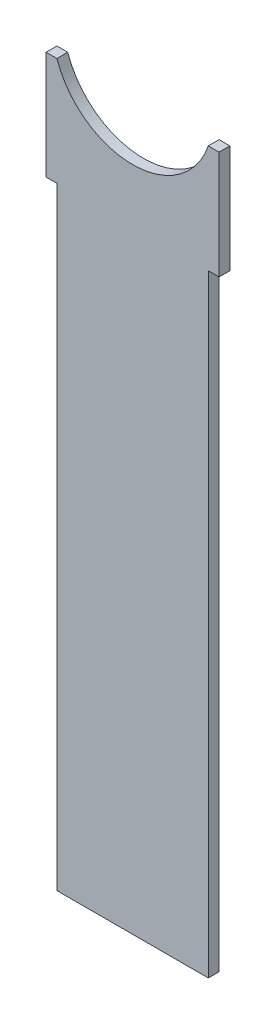
ISO-10303-21;
HEADER;
FILE_DESCRIPTION(('STEP AP214'),'2;1');
FILE_NAME('part.step','',(''),(''),'','','');
FILE_SCHEMA(('AUTOMOTIVE_DESIGN { 1 0 10303 214 1 1 1 1 }'));
ENDSEC;
DATA;
#1=APPLICATION_CONTEXT('core data for automotive mechanical design processes');
#2=APPLICATION_PROTOCOL_DEFINITION('international standard','automotive_design',2000,#1);
#3=PRODUCT_CONTEXT('',#1,'mechanical');
#4=PRODUCT('Part','Part','',(#3));
#5=PRODUCT_RELATED_PRODUCT_CATEGORY('part','',(#4));
#6=PRODUCT_DEFINITION_FORMATION('','',#4);
#7=PRODUCT_DEFINITION_CONTEXT('part definition',#1,'design');
#8=PRODUCT_DEFINITION('design','',#6,#7);
#9=PRODUCT_DEFINITION_SHAPE('','',#8);
#10=(LENGTH_UNIT() NAMED_UNIT(*) SI_UNIT(.MILLI.,.METRE.));
#11=(NAMED_UNIT(*) PLANE_ANGLE_UNIT() SI_UNIT($,.RADIAN.));
#12=(NAMED_UNIT(*) SI_UNIT($,.STERADIAN.) SOLID_ANGLE_UNIT());
#13=UNCERTAINTY_MEASURE_WITH_UNIT(LENGTH_MEASURE(1.E-05),#10,'distance_accuracy_value','');
#14=(GEOMETRIC_REPRESENTATION_CONTEXT(3) GLOBAL_UNCERTAINTY_ASSIGNED_CONTEXT((#13)) GLOBAL_UNIT_ASSIGNED_CONTEXT((#10,
#11,#12)) REPRESENTATION_CONTEXT('',''));
#15=CARTESIAN_POINT('',(0.,0.,0.));
#16=DIRECTION('',(0.,0.,1.));
#17=DIRECTION('',(1.,0.,0.));
#18=AXIS2_PLACEMENT_3D('',#15,#16,#17);
#19=CARTESIAN_POINT('',(12.7,0.,1.5875));
#20=DIRECTION('',(-1.,0.,0.));
#21=DIRECTION('',(0.,-1.,0.));
#22=AXIS2_PLACEMENT_3D('',#19,#20,#21);
#23=PLANE('',#22);
#24=DIRECTION('',(0.,1.,0.));
#25=VECTOR('',#24,1.);
#26=CARTESIAN_POINT('',(12.7,0.,0.));
#27=LINE('',#26,#25);
#28=CARTESIAN_POINT('',(12.7,-15.875,0.));
#29=VERTEX_POINT('',#28);
#30=CARTESIAN_POINT('',(12.7,0.,0.));
#31=VERTEX_POINT('',#30);
#32=EDGE_CURVE('E141',#29,#31,#27,.T.);
#33=ORIENTED_EDGE('',*,*,#32,.T.);
#34=DIRECTION('',(0.,0.,-1.));
#35=VECTOR('',#34,1.);
#36=CARTESIAN_POINT('',(12.7,0.,1.5875));
#37=LINE('',#36,#35);
#38=CARTESIAN_POINT('',(12.7,0.,1.5875));
#39=VERTEX_POINT('',#38);
#40=EDGE_CURVE('E11',#39,#31,#37,.T.);
#41=ORIENTED_EDGE('',*,*,#40,.F.);
#42=DIRECTION('',(0.,1.,0.));
#43=VECTOR('',#42,1.);
#44=CARTESIAN_POINT('',(12.7,0.,1.5875));
#45=LINE('',#44,#43);
#46=CARTESIAN_POINT('',(12.7,-15.875,1.5875));
#47=VERTEX_POINT('',#46);
#48=EDGE_CURVE('E92',#47,#39,#45,.T.);
#49=ORIENTED_EDGE('',*,*,#48,.F.);
#50=DIRECTION('',(0.,0.,-1.));
#51=VECTOR('',#50,1.);
#52=CARTESIAN_POINT('',(12.7,-15.875,1.5875));
#53=LINE('',#52,#51);
#54=EDGE_CURVE('E137',#47,#29,#53,.T.);
#55=ORIENTED_EDGE('',*,*,#54,.T.);
#56=EDGE_LOOP('',(#33,#41,#49,#55));
#57=FACE_BOUND('',#56,.T.);
#58=ADVANCED_FACE('F34',(#57),#23,.F.);
#59=CARTESIAN_POINT('',(0.,0.,1.5875));
#60=DIRECTION('',(0.,1.,0.));
#61=DIRECTION('',(-1.,0.,0.));
#62=AXIS2_PLACEMENT_3D('',#59,#60,#61);
#63=PLANE('',#62);
#64=DIRECTION('',(1.,0.,0.));
#65=VECTOR('',#64,1.);
#66=CARTESIAN_POINT('',(0.,0.,0.));
#67=LINE('',#66,#65);
#68=CARTESIAN_POINT('',(11.1125,0.,0.));
#69=VERTEX_POINT('',#68);
#70=EDGE_CURVE('E144',#69,#31,#67,.T.);
#71=ORIENTED_EDGE('',*,*,#70,.F.);
#72=DIRECTION('',(0.,0.,-1.));
#73=VECTOR('',#72,1.);
#74=CARTESIAN_POINT('',(11.1125,0.,1.5875));
#75=LINE('',#74,#73);
#76=CARTESIAN_POINT('',(11.1125,0.,1.5875));
#77=VERTEX_POINT('',#76);
#78=EDGE_CURVE('E42',#77,#69,#75,.T.);
#79=ORIENTED_EDGE('',*,*,#78,.F.);
#80=DIRECTION('',(1.,0.,0.));
#81=VECTOR('',#80,1.);
#82=CARTESIAN_POINT('',(0.,0.,1.5875));
#83=LINE('',#82,#81);
#84=EDGE_CURVE('E199',#77,#39,#83,.T.);
#85=ORIENTED_EDGE('',*,*,#84,.T.);
#86=ORIENTED_EDGE('',*,*,#40,.T.);
#87=EDGE_LOOP('',(#71,#79,#85,#86));
#88=FACE_BOUND('',#87,.T.);
#89=ADVANCED_FACE('F184',(#88),#63,.T.);
#90=CARTESIAN_POINT('',(0.,3.80999999999999,1.5875));
#91=DIRECTION('',(0.,0.,-1.));
#92=DIRECTION('',(-1.,0.,0.));
#93=AXIS2_PLACEMENT_3D('',#90,#91,#92);
#94=CYLINDRICAL_SURFACE('',#93,11.7475);
#95=CARTESIAN_POINT('',(0.,3.80999999999999,0.));
#96=DIRECTION('',(0.,0.,1.));
#97=DIRECTION('',(1.,0.,0.));
#98=AXIS2_PLACEMENT_3D('',#95,#96,#97);
#99=CIRCLE('',#98,11.7475);
#100=CARTESIAN_POINT('',(-11.1125,0.,0.));
#101=VERTEX_POINT('',#100);
#102=EDGE_CURVE('E147',#101,#69,#99,.T.);
#103=ORIENTED_EDGE('',*,*,#102,.F.);
#104=DIRECTION('',(0.,0.,-1.));
#105=VECTOR('',#104,1.);
#106=CARTESIAN_POINT('',(-11.1125,0.,1.5875));
#107=LINE('',#106,#105);
#108=CARTESIAN_POINT('',(-11.1125,0.,1.5875));
#109=VERTEX_POINT('',#108);
#110=EDGE_CURVE('E174',#109,#101,#107,.T.);
#111=ORIENTED_EDGE('',*,*,#110,.F.);
#112=CARTESIAN_POINT('',(0.,3.80999999999999,1.5875));
#113=DIRECTION('',(0.,0.,1.));
#114=DIRECTION('',(1.,0.,0.));
#115=AXIS2_PLACEMENT_3D('',#112,#113,#114);
#116=CIRCLE('',#115,11.7475);
#117=EDGE_CURVE('E181',#109,#77,#116,.T.);
#118=ORIENTED_EDGE('',*,*,#117,.T.);
#119=ORIENTED_EDGE('',*,*,#78,.T.);
#120=EDGE_LOOP('',(#103,#111,#118,#119));
#121=FACE_BOUND('',#120,.T.);
#122=ADVANCED_FACE('F179',(#121),#94,.F.);
#123=CARTESIAN_POINT('',(0.,0.,1.5875));
#124=DIRECTION('',(0.,-1.,0.));
#125=DIRECTION('',(1.,0.,0.));
#126=AXIS2_PLACEMENT_3D('',#123,#124,#125);
#127=PLANE('',#126);
#128=DIRECTION('',(-1.,0.,0.));
#129=VECTOR('',#128,1.);
#130=CARTESIAN_POINT('',(0.,0.,0.));
#131=LINE('',#130,#129);
#132=CARTESIAN_POINT('',(-12.7,0.,0.));
#133=VERTEX_POINT('',#132);
#134=EDGE_CURVE('E150',#101,#133,#131,.T.);
#135=ORIENTED_EDGE('',*,*,#134,.T.);
#136=DIRECTION('',(0.,0.,-1.));
#137=VECTOR('',#136,1.);
#138=CARTESIAN_POINT('',(-12.7,0.,1.5875));
#139=LINE('',#138,#137);
#140=CARTESIAN_POINT('',(-12.7,0.,1.5875));
#141=VERTEX_POINT('',#140);
#142=EDGE_CURVE('E172',#141,#133,#139,.T.);
#143=ORIENTED_EDGE('',*,*,#142,.F.);
#144=DIRECTION('',(-1.,0.,0.));
#145=VECTOR('',#144,1.);
#146=CARTESIAN_POINT('',(0.,0.,1.5875));
#147=LINE('',#146,#145);
#148=EDGE_CURVE('E195',#109,#141,#147,.T.);
#149=ORIENTED_EDGE('',*,*,#148,.F.);
#150=ORIENTED_EDGE('',*,*,#110,.T.);
#151=EDGE_LOOP('',(#135,#143,#149,#150));
#152=FACE_BOUND('',#151,.T.);
#153=ADVANCED_FACE('F192',(#152),#127,.F.);
#154=CARTESIAN_POINT('',(-12.7,0.,1.5875));
#155=DIRECTION('',(-1.,0.,0.));
#156=DIRECTION('',(0.,-1.,0.));
#157=AXIS2_PLACEMENT_3D('',#154,#155,#156);
#158=PLANE('',#157);
#159=DIRECTION('',(0.,1.,0.));
#160=VECTOR('',#159,1.);
#161=CARTESIAN_POINT('',(-12.7,0.,0.));
#162=LINE('',#161,#160);
#163=CARTESIAN_POINT('',(-12.7,-15.875,0.));
#164=VERTEX_POINT('',#163);
#165=EDGE_CURVE('E153',#164,#133,#162,.T.);
#166=ORIENTED_EDGE('',*,*,#165,.F.);
#167=DIRECTION('',(0.,0.,-1.));
#168=VECTOR('',#167,1.);
#169=CARTESIAN_POINT('',(-12.7,-15.875,1.5875));
#170=LINE('',#169,#168);
#171=CARTESIAN_POINT('',(-12.7,-15.875,1.5875));
#172=VERTEX_POINT('',#171);
#173=EDGE_CURVE('E170',#172,#164,#170,.T.);
#174=ORIENTED_EDGE('',*,*,#173,.F.);
#175=DIRECTION('',(0.,1.,0.));
#176=VECTOR('',#175,1.);
#177=CARTESIAN_POINT('',(-12.7,0.,1.5875));
#178=LINE('',#177,#176);
#179=EDGE_CURVE('E197',#172,#141,#178,.T.);
#180=ORIENTED_EDGE('',*,*,#179,.T.);
#181=ORIENTED_EDGE('',*,*,#142,.T.);
#182=EDGE_LOOP('',(#166,#174,#180,#181));
#183=FACE_BOUND('',#182,.T.);
#184=ADVANCED_FACE('F211',(#183),#158,.T.);
#185=CARTESIAN_POINT('',(0.,-15.875,1.5875));
#186=DIRECTION('',(0.,-1.,0.));
#187=DIRECTION('',(1.,0.,0.));
#188=AXIS2_PLACEMENT_3D('',#185,#186,#187);
#189=PLANE('',#188);
#190=DIRECTION('',(-1.,0.,0.));
#191=VECTOR('',#190,1.);
#192=CARTESIAN_POINT('',(0.,-15.875,0.));
#193=LINE('',#192,#191);
#194=CARTESIAN_POINT('',(-11.1125,-15.875,0.));
#195=VERTEX_POINT('',#194);
#196=EDGE_CURVE('E156',#195,#164,#193,.T.);
#197=ORIENTED_EDGE('',*,*,#196,.F.);
#198=DIRECTION('',(0.,0.,-1.));
#199=VECTOR('',#198,1.);
#200=CARTESIAN_POINT('',(-11.1125,-15.875,1.5875));
#201=LINE('',#200,#199);
#202=CARTESIAN_POINT('',(-11.1125,-15.875,1.5875));
#203=VERTEX_POINT('',#202);
#204=EDGE_CURVE('E168',#203,#195,#201,.T.);
#205=ORIENTED_EDGE('',*,*,#204,.F.);
#206=DIRECTION('',(-1.,0.,0.));
#207=VECTOR('',#206,1.);
#208=CARTESIAN_POINT('',(0.,-15.875,1.5875));
#209=LINE('',#208,#207);
#210=EDGE_CURVE('E205',#203,#172,#209,.T.);
#211=ORIENTED_EDGE('',*,*,#210,.T.);
#212=ORIENTED_EDGE('',*,*,#173,.T.);
#213=EDGE_LOOP('',(#197,#205,#211,#212));
#214=FACE_BOUND('',#213,.T.);
#215=ADVANCED_FACE('F209',(#214),#189,.T.);
#216=CARTESIAN_POINT('',(-11.1125,0.,1.5875));
#217=DIRECTION('',(1.,0.,0.));
#218=DIRECTION('',(0.,1.,0.));
#219=AXIS2_PLACEMENT_3D('',#216,#217,#218);
#220=PLANE('',#219);
#221=DIRECTION('',(0.,-1.,0.));
#222=VECTOR('',#221,1.);
#223=CARTESIAN_POINT('',(-11.1125,0.,0.));
#224=LINE('',#223,#222);
#225=CARTESIAN_POINT('',(-11.1125,-105.804584262909,0.));
#226=VERTEX_POINT('',#225);
#227=EDGE_CURVE('E159',#195,#226,#224,.T.);
#228=ORIENTED_EDGE('',*,*,#227,.T.);
#229=DIRECTION('',(0.,0.,-1.));
#230=VECTOR('',#229,1.);
#231=CARTESIAN_POINT('',(-11.1125,-105.804584262909,1.5875));
#232=LINE('',#231,#230);
#233=CARTESIAN_POINT('',(-11.1125,-105.804584262909,1.5875));
#234=VERTEX_POINT('',#233);
#235=EDGE_CURVE('E133',#234,#226,#232,.T.);
#236=ORIENTED_EDGE('',*,*,#235,.F.);
#237=DIRECTION('',(0.,-1.,0.));
#238=VECTOR('',#237,1.);
#239=CARTESIAN_POINT('',(-11.1125,0.,1.5875));
#240=LINE('',#239,#238);
#241=EDGE_CURVE('E120',#203,#234,#240,.T.);
#242=ORIENTED_EDGE('',*,*,#241,.F.);
#243=ORIENTED_EDGE('',*,*,#204,.T.);
#244=EDGE_LOOP('',(#228,#236,#242,#243));
#245=FACE_BOUND('',#244,.T.);
#246=ADVANCED_FACE('F214',(#245),#220,.F.);
#247=CARTESIAN_POINT('',(0.,-105.804584262909,1.5875));
#248=DIRECTION('',(0.,1.,0.));
#249=DIRECTION('',(0.,0.,1.));
#250=AXIS2_PLACEMENT_3D('',#247,#248,#249);
#251=PLANE('',#250);
#252=DIRECTION('',(1.,0.,0.));
#253=VECTOR('',#252,1.);
#254=CARTESIAN_POINT('',(0.,-105.804584262909,0.));
#255=LINE('',#254,#253);
#256=CARTESIAN_POINT('',(11.1125,-105.804584262909,0.));
#257=VERTEX_POINT('',#256);
#258=EDGE_CURVE('E129',#226,#257,#255,.T.);
#259=ORIENTED_EDGE('',*,*,#258,.T.);
#260=DIRECTION('',(0.,0.,-1.));
#261=VECTOR('',#260,1.);
#262=CARTESIAN_POINT('',(11.1125,-105.804584262909,1.5875));
#263=LINE('',#262,#261);
#264=CARTESIAN_POINT('',(11.1125,-105.804584262909,1.5875));
#265=VERTEX_POINT('',#264);
#266=EDGE_CURVE('E126',#265,#257,#263,.T.);
#267=ORIENTED_EDGE('',*,*,#266,.F.);
#268=DIRECTION('',(1.,0.,0.));
#269=VECTOR('',#268,1.);
#270=CARTESIAN_POINT('',(0.,-105.804584262909,1.5875));
#271=LINE('',#270,#269);
#272=EDGE_CURVE('E113',#234,#265,#271,.T.);
#273=ORIENTED_EDGE('',*,*,#272,.F.);
#274=ORIENTED_EDGE('',*,*,#235,.T.);
#275=EDGE_LOOP('',(#259,#267,#273,#274));
#276=FACE_BOUND('',#275,.T.);
#277=ADVANCED_FACE('F127',(#276),#251,.F.);
#278=CARTESIAN_POINT('',(11.1125,0.,1.5875));
#279=DIRECTION('',(1.,0.,0.));
#280=DIRECTION('',(0.,1.,0.));
#281=AXIS2_PLACEMENT_3D('',#278,#279,#280);
#282=PLANE('',#281);
#283=DIRECTION('',(0.,-1.,0.));
#284=VECTOR('',#283,1.);
#285=CARTESIAN_POINT('',(11.1125,0.,0.));
#286=LINE('',#285,#284);
#287=CARTESIAN_POINT('',(11.1125,-15.875,0.));
#288=VERTEX_POINT('',#287);
#289=EDGE_CURVE('E162',#288,#257,#286,.T.);
#290=ORIENTED_EDGE('',*,*,#289,.F.);
#291=DIRECTION('',(0.,0.,-1.));
#292=VECTOR('',#291,1.);
#293=CARTESIAN_POINT('',(11.1125,-15.875,1.5875));
#294=LINE('',#293,#292);
#295=CARTESIAN_POINT('',(11.1125,-15.875,1.5875));
#296=VERTEX_POINT('',#295);
#297=EDGE_CURVE('E83',#296,#288,#294,.T.);
#298=ORIENTED_EDGE('',*,*,#297,.F.);
#299=DIRECTION('',(0.,-1.,0.));
#300=VECTOR('',#299,1.);
#301=CARTESIAN_POINT('',(11.1125,0.,1.5875));
#302=LINE('',#301,#300);
#303=EDGE_CURVE('E117',#296,#265,#302,.T.);
#304=ORIENTED_EDGE('',*,*,#303,.T.);
#305=ORIENTED_EDGE('',*,*,#266,.T.);
#306=EDGE_LOOP('',(#290,#298,#304,#305));
#307=FACE_BOUND('',#306,.T.);
#308=ADVANCED_FACE('F135',(#307),#282,.T.);
#309=CARTESIAN_POINT('',(0.,-15.875,1.5875));
#310=DIRECTION('',(0.,1.,0.));
#311=DIRECTION('',(-1.,0.,0.));
#312=AXIS2_PLACEMENT_3D('',#309,#310,#311);
#313=PLANE('',#312);
#314=DIRECTION('',(1.,0.,0.));
#315=VECTOR('',#314,1.);
#316=CARTESIAN_POINT('',(0.,-15.875,0.));
#317=LINE('',#316,#315);
#318=EDGE_CURVE('E86',#288,#29,#317,.T.);
#319=ORIENTED_EDGE('',*,*,#318,.T.);
#320=ORIENTED_EDGE('',*,*,#54,.F.);
#321=DIRECTION('',(1.,0.,0.));
#322=VECTOR('',#321,1.);
#323=CARTESIAN_POINT('',(0.,-15.875,1.5875));
#324=LINE('',#323,#322);
#325=EDGE_CURVE('E50',#296,#47,#324,.T.);
#326=ORIENTED_EDGE('',*,*,#325,.F.);
#327=ORIENTED_EDGE('',*,*,#297,.T.);
#328=EDGE_LOOP('',(#319,#320,#326,#327));
#329=FACE_BOUND('',#328,.T.);
#330=ADVANCED_FACE('F228',(#329),#313,.F.);
#331=CARTESIAN_POINT('',(0.,0.,1.5875));
#332=DIRECTION('',(0.,0.,1.));
#333=DIRECTION('',(1.,0.,0.));
#334=AXIS2_PLACEMENT_3D('',#331,#332,#333);
#335=PLANE('',#334);
#336=ORIENTED_EDGE('',*,*,#48,.T.);
#337=ORIENTED_EDGE('',*,*,#84,.F.);
#338=ORIENTED_EDGE('',*,*,#117,.F.);
#339=ORIENTED_EDGE('',*,*,#148,.T.);
#340=ORIENTED_EDGE('',*,*,#179,.F.);
#341=ORIENTED_EDGE('',*,*,#210,.F.);
#342=ORIENTED_EDGE('',*,*,#241,.T.);
#343=ORIENTED_EDGE('',*,*,#272,.T.);
#344=ORIENTED_EDGE('',*,*,#303,.F.);
#345=ORIENTED_EDGE('',*,*,#325,.T.);
#346=EDGE_LOOP('',(#336,#337,#338,#339,#340,#341,#342,#343,#344,#345));
#347=FACE_BOUND('',#346,.T.);
#348=ADVANCED_FACE('F115',(#347),#335,.T.);
#349=CARTESIAN_POINT('',(0.,0.,0.));
#350=DIRECTION('',(0.,0.,1.));
#351=DIRECTION('',(1.,0.,0.));
#352=AXIS2_PLACEMENT_3D('',#349,#350,#351);
#353=PLANE('',#352);
#354=ORIENTED_EDGE('',*,*,#32,.F.);
#355=ORIENTED_EDGE('',*,*,#318,.F.);
#356=ORIENTED_EDGE('',*,*,#289,.T.);
#357=ORIENTED_EDGE('',*,*,#258,.F.);
#358=ORIENTED_EDGE('',*,*,#227,.F.);
#359=ORIENTED_EDGE('',*,*,#196,.T.);
#360=ORIENTED_EDGE('',*,*,#165,.T.);
#361=ORIENTED_EDGE('',*,*,#134,.F.);
#362=ORIENTED_EDGE('',*,*,#102,.T.);
#363=ORIENTED_EDGE('',*,*,#70,.T.);
#364=EDGE_LOOP('',(#354,#355,#356,#357,#358,#359,#360,#361,#362,#363));
#365=FACE_BOUND('',#364,.T.);
#366=ADVANCED_FACE('F188',(#365),#353,.F.);
#367=CLOSED_SHELL('',(#58,#89,#122,#153,#184,#215,#246,#277,#308,#330,#348,#366));
#368=MANIFOLD_SOLID_BREP('B2',#367);
#369=ADVANCED_BREP_SHAPE_REPRESENTATION('',(#18,#368),#14);
#370=SHAPE_DEFINITION_REPRESENTATION(#9,#369);
ENDSEC;
END-ISO-10303-21;
